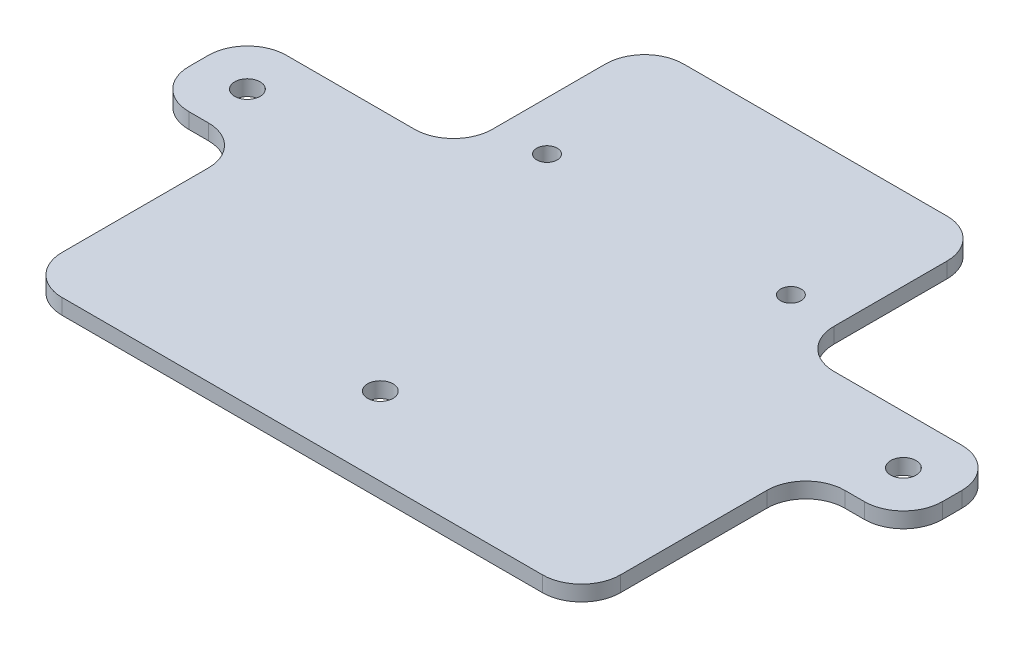
ISO-10303-21;
HEADER;
FILE_DESCRIPTION(('STEP AP214'),'2;1');
FILE_NAME('part.step','',(''),(''),'','','');
FILE_SCHEMA(('AUTOMOTIVE_DESIGN { 1 0 10303 214 1 1 1 1 }'));
ENDSEC;
DATA;
#1=APPLICATION_CONTEXT('core data for automotive mechanical design processes');
#2=APPLICATION_PROTOCOL_DEFINITION('international standard','automotive_design',2000,#1);
#3=PRODUCT_CONTEXT('',#1,'mechanical');
#4=PRODUCT('Part','Part','',(#3));
#5=PRODUCT_RELATED_PRODUCT_CATEGORY('part','',(#4));
#6=PRODUCT_DEFINITION_FORMATION('','',#4);
#7=PRODUCT_DEFINITION_CONTEXT('part definition',#1,'design');
#8=PRODUCT_DEFINITION('design','',#6,#7);
#9=PRODUCT_DEFINITION_SHAPE('','',#8);
#10=(LENGTH_UNIT() NAMED_UNIT(*) SI_UNIT(.MILLI.,.METRE.));
#11=(NAMED_UNIT(*) PLANE_ANGLE_UNIT() SI_UNIT($,.RADIAN.));
#12=(NAMED_UNIT(*) SI_UNIT($,.STERADIAN.) SOLID_ANGLE_UNIT());
#13=UNCERTAINTY_MEASURE_WITH_UNIT(LENGTH_MEASURE(1.E-05),#10,'distance_accuracy_value','');
#14=(GEOMETRIC_REPRESENTATION_CONTEXT(3) GLOBAL_UNCERTAINTY_ASSIGNED_CONTEXT((#13)) GLOBAL_UNIT_ASSIGNED_CONTEXT((#10,
#11,#12)) REPRESENTATION_CONTEXT('',''));
#15=CARTESIAN_POINT('',(0.,0.,0.));
#16=DIRECTION('',(0.,0.,1.));
#17=DIRECTION('',(1.,0.,0.));
#18=AXIS2_PLACEMENT_3D('',#15,#16,#17);
#19=CARTESIAN_POINT('',(0.,3.175,0.));
#20=DIRECTION('',(0.,1.,0.));
#21=DIRECTION('',(0.,0.,1.));
#22=AXIS2_PLACEMENT_3D('',#19,#20,#21);
#23=PLANE('',#22);
#24=CARTESIAN_POINT('',(67.25,3.175,94.175));
#25=DIRECTION('',(0.,1.,0.));
#26=DIRECTION('',(0.,0.,1.));
#27=AXIS2_PLACEMENT_3D('',#24,#25,#26);
#28=CIRCLE('',#27,2.6);
#29=CARTESIAN_POINT('',(67.25,3.175,96.775));
#30=VERTEX_POINT('',#29);
#31=EDGE_CURVE('E752',#30,#30,#28,.T.);
#32=ORIENTED_EDGE('',*,*,#31,.F.);
#33=EDGE_LOOP('',(#32));
#34=FACE_BOUND('',#33,.T.);
#35=CARTESIAN_POINT('',(25.,3.175,75.));
#36=DIRECTION('',(0.,1.,0.));
#37=DIRECTION('',(0.,0.,1.));
#38=AXIS2_PLACEMENT_3D('',#35,#36,#37);
#39=CIRCLE('',#38,2.1);
#40=CARTESIAN_POINT('',(25.,3.175,77.1));
#41=VERTEX_POINT('',#40);
#42=EDGE_CURVE('E737',#41,#41,#39,.T.);
#43=ORIENTED_EDGE('',*,*,#42,.F.);
#44=EDGE_LOOP('',(#43));
#45=FACE_BOUND('',#44,.T.);
#46=DIRECTION('',(-1.,0.,0.));
#47=VECTOR('',#46,1.);
#48=CARTESIAN_POINT('',(-35.,3.175,84.175));
#49=LINE('',#48,#47);
#50=CARTESIAN_POINT('',(-43.,3.175,84.175));
#51=VERTEX_POINT('',#50);
#52=CARTESIAN_POINT('',(-69.25,3.175,84.175));
#53=VERTEX_POINT('',#52);
#54=EDGE_CURVE('E216',#51,#53,#49,.T.);
#55=ORIENTED_EDGE('',*,*,#54,.T.);
#56=CARTESIAN_POINT('',(-69.25,3.175,92.175));
#57=DIRECTION('',(0.,1.,0.));
#58=DIRECTION('',(0.,0.,1.));
#59=AXIS2_PLACEMENT_3D('',#56,#57,#58);
#60=CIRCLE('',#59,8.);
#61=CARTESIAN_POINT('',(-77.25,3.175,92.175));
#62=VERTEX_POINT('',#61);
#63=EDGE_CURVE('E301',#53,#62,#60,.T.);
#64=ORIENTED_EDGE('',*,*,#63,.T.);
#65=DIRECTION('',(0.,0.,1.));
#66=VECTOR('',#65,1.);
#67=CARTESIAN_POINT('',(-77.25,3.175,84.175));
#68=LINE('',#67,#66);
#69=CARTESIAN_POINT('',(-77.25,3.175,96.175));
#70=VERTEX_POINT('',#69);
#71=EDGE_CURVE('E385',#62,#70,#68,.T.);
#72=ORIENTED_EDGE('',*,*,#71,.T.);
#73=CARTESIAN_POINT('',(-69.25,3.175,96.175));
#74=DIRECTION('',(0.,1.,0.));
#75=DIRECTION('',(0.,0.,1.));
#76=AXIS2_PLACEMENT_3D('',#73,#74,#75);
#77=CIRCLE('',#76,8.);
#78=CARTESIAN_POINT('',(-69.25,3.175,104.175));
#79=VERTEX_POINT('',#78);
#80=EDGE_CURVE('E299',#70,#79,#77,.T.);
#81=ORIENTED_EDGE('',*,*,#80,.T.);
#82=DIRECTION('',(1.,0.,0.));
#83=VECTOR('',#82,1.);
#84=CARTESIAN_POINT('',(-77.25,3.175,104.175));
#85=LINE('',#84,#83);
#86=CARTESIAN_POINT('',(-65.25,3.175,104.175));
#87=VERTEX_POINT('',#86);
#88=EDGE_CURVE('E388',#79,#87,#85,.T.);
#89=ORIENTED_EDGE('',*,*,#88,.T.);
#90=CARTESIAN_POINT('',(-65.25,3.175,112.175));
#91=DIRECTION('',(0.,1.,0.));
#92=DIRECTION('',(0.,0.,1.));
#93=AXIS2_PLACEMENT_3D('',#90,#91,#92);
#94=CIRCLE('',#93,8.);
#95=CARTESIAN_POINT('',(-57.25,3.175,112.175));
#96=VERTEX_POINT('',#95);
#97=EDGE_CURVE('E351',#87,#96,#94,.F.);
#98=ORIENTED_EDGE('',*,*,#97,.T.);
#99=DIRECTION('',(0.,0.,1.));
#100=VECTOR('',#99,1.);
#101=CARTESIAN_POINT('',(-57.25,3.175,104.175));
#102=LINE('',#101,#100);
#103=CARTESIAN_POINT('',(-57.25,3.175,142.175));
#104=VERTEX_POINT('',#103);
#105=EDGE_CURVE('E391',#96,#104,#102,.T.);
#106=ORIENTED_EDGE('',*,*,#105,.T.);
#107=CARTESIAN_POINT('',(-49.25,3.175,142.175));
#108=DIRECTION('',(0.,1.,0.));
#109=DIRECTION('',(0.,0.,1.));
#110=AXIS2_PLACEMENT_3D('',#107,#108,#109);
#111=CIRCLE('',#110,8.);
#112=CARTESIAN_POINT('',(-49.25,3.175,150.175));
#113=VERTEX_POINT('',#112);
#114=EDGE_CURVE('E297',#104,#113,#111,.T.);
#115=ORIENTED_EDGE('',*,*,#114,.T.);
#116=DIRECTION('',(1.,0.,0.));
#117=VECTOR('',#116,1.);
#118=CARTESIAN_POINT('',(-57.25,3.175,150.175));
#119=LINE('',#118,#117);
#120=CARTESIAN_POINT('',(49.25,3.175,150.175));
#121=VERTEX_POINT('',#120);
#122=EDGE_CURVE('E395',#113,#121,#119,.T.);
#123=ORIENTED_EDGE('',*,*,#122,.T.);
#124=CARTESIAN_POINT('',(49.25,3.175,142.175));
#125=DIRECTION('',(0.,1.,0.));
#126=DIRECTION('',(0.,0.,1.));
#127=AXIS2_PLACEMENT_3D('',#124,#125,#126);
#128=CIRCLE('',#127,8.);
#129=CARTESIAN_POINT('',(57.25,3.175,142.175));
#130=VERTEX_POINT('',#129);
#131=EDGE_CURVE('E294',#121,#130,#128,.T.);
#132=ORIENTED_EDGE('',*,*,#131,.T.);
#133=DIRECTION('',(0.,0.,-1.));
#134=VECTOR('',#133,1.);
#135=CARTESIAN_POINT('',(57.25,3.175,104.175));
#136=LINE('',#135,#134);
#137=CARTESIAN_POINT('',(57.25,3.175,112.175));
#138=VERTEX_POINT('',#137);
#139=EDGE_CURVE('E398',#130,#138,#136,.T.);
#140=ORIENTED_EDGE('',*,*,#139,.T.);
#141=CARTESIAN_POINT('',(65.25,3.175,112.175));
#142=DIRECTION('',(0.,1.,0.));
#143=DIRECTION('',(0.,0.,1.));
#144=AXIS2_PLACEMENT_3D('',#141,#142,#143);
#145=CIRCLE('',#144,8.);
#146=CARTESIAN_POINT('',(65.25,3.175,104.175));
#147=VERTEX_POINT('',#146);
#148=EDGE_CURVE('E355',#138,#147,#145,.F.);
#149=ORIENTED_EDGE('',*,*,#148,.T.);
#150=DIRECTION('',(1.,0.,0.));
#151=VECTOR('',#150,1.);
#152=CARTESIAN_POINT('',(77.25,3.175,104.175));
#153=LINE('',#152,#151);
#154=CARTESIAN_POINT('',(69.25,3.175,104.175));
#155=VERTEX_POINT('',#154);
#156=EDGE_CURVE('E402',#147,#155,#153,.T.);
#157=ORIENTED_EDGE('',*,*,#156,.T.);
#158=CARTESIAN_POINT('',(69.25,3.175,96.175));
#159=DIRECTION('',(0.,1.,0.));
#160=DIRECTION('',(0.,0.,1.));
#161=AXIS2_PLACEMENT_3D('',#158,#159,#160);
#162=CIRCLE('',#161,8.);
#163=CARTESIAN_POINT('',(77.25,3.175,96.175));
#164=VERTEX_POINT('',#163);
#165=EDGE_CURVE('E292',#155,#164,#162,.T.);
#166=ORIENTED_EDGE('',*,*,#165,.T.);
#167=DIRECTION('',(0.,0.,-1.));
#168=VECTOR('',#167,1.);
#169=CARTESIAN_POINT('',(77.25,3.175,84.175));
#170=LINE('',#169,#168);
#171=CARTESIAN_POINT('',(77.25,3.175,92.175));
#172=VERTEX_POINT('',#171);
#173=EDGE_CURVE('E405',#164,#172,#170,.T.);
#174=ORIENTED_EDGE('',*,*,#173,.T.);
#175=CARTESIAN_POINT('',(69.25,3.175,92.175));
#176=DIRECTION('',(0.,1.,0.));
#177=DIRECTION('',(0.,0.,1.));
#178=AXIS2_PLACEMENT_3D('',#175,#176,#177);
#179=CIRCLE('',#178,8.);
#180=CARTESIAN_POINT('',(69.25,3.175,84.175));
#181=VERTEX_POINT('',#180);
#182=EDGE_CURVE('E56',#172,#181,#179,.T.);
#183=ORIENTED_EDGE('',*,*,#182,.T.);
#184=DIRECTION('',(-1.,0.,0.));
#185=VECTOR('',#184,1.);
#186=CARTESIAN_POINT('',(35.,3.175,84.175));
#187=LINE('',#186,#185);
#188=CARTESIAN_POINT('',(43.,3.175,84.175));
#189=VERTEX_POINT('',#188);
#190=EDGE_CURVE('E258',#181,#189,#187,.T.);
#191=ORIENTED_EDGE('',*,*,#190,.T.);
#192=CARTESIAN_POINT('',(43.,3.175,76.175));
#193=DIRECTION('',(0.,1.,0.));
#194=DIRECTION('',(0.,0.,1.));
#195=AXIS2_PLACEMENT_3D('',#192,#193,#194);
#196=CIRCLE('',#195,8.);
#197=CARTESIAN_POINT('',(35.,3.175,76.175));
#198=VERTEX_POINT('',#197);
#199=EDGE_CURVE('E11',#189,#198,#196,.F.);
#200=ORIENTED_EDGE('',*,*,#199,.T.);
#201=DIRECTION('',(0.,0.,-1.));
#202=VECTOR('',#201,1.);
#203=CARTESIAN_POINT('',(35.,3.175,45.));
#204=LINE('',#203,#202);
#205=CARTESIAN_POINT('',(35.,3.175,53.));
#206=VERTEX_POINT('',#205);
#207=EDGE_CURVE('E257',#198,#206,#204,.T.);
#208=ORIENTED_EDGE('',*,*,#207,.T.);
#209=CARTESIAN_POINT('',(27.,3.175,53.));
#210=DIRECTION('',(0.,1.,0.));
#211=DIRECTION('',(0.,0.,1.));
#212=AXIS2_PLACEMENT_3D('',#209,#210,#211);
#213=CIRCLE('',#212,8.);
#214=CARTESIAN_POINT('',(27.,3.175,45.));
#215=VERTEX_POINT('',#214);
#216=EDGE_CURVE('E286',#206,#215,#213,.T.);
#217=ORIENTED_EDGE('',*,*,#216,.T.);
#218=DIRECTION('',(-1.,0.,0.));
#219=VECTOR('',#218,1.);
#220=CARTESIAN_POINT('',(-35.,3.175,45.));
#221=LINE('',#220,#219);
#222=CARTESIAN_POINT('',(-27.,3.175,45.));
#223=VERTEX_POINT('',#222);
#224=EDGE_CURVE('E373',#215,#223,#221,.T.);
#225=ORIENTED_EDGE('',*,*,#224,.T.);
#226=CARTESIAN_POINT('',(-27.,3.175,53.));
#227=DIRECTION('',(0.,1.,0.));
#228=DIRECTION('',(0.,0.,1.));
#229=AXIS2_PLACEMENT_3D('',#226,#227,#228);
#230=CIRCLE('',#229,8.);
#231=CARTESIAN_POINT('',(-35.,3.175,53.));
#232=VERTEX_POINT('',#231);
#233=EDGE_CURVE('E288',#223,#232,#230,.T.);
#234=ORIENTED_EDGE('',*,*,#233,.T.);
#235=DIRECTION('',(0.,0.,1.));
#236=VECTOR('',#235,1.);
#237=CARTESIAN_POINT('',(-35.,3.175,45.));
#238=LINE('',#237,#236);
#239=CARTESIAN_POINT('',(-35.,3.175,76.175));
#240=VERTEX_POINT('',#239);
#241=EDGE_CURVE('E376',#232,#240,#238,.T.);
#242=ORIENTED_EDGE('',*,*,#241,.T.);
#243=CARTESIAN_POINT('',(-43.,3.175,76.175));
#244=DIRECTION('',(0.,1.,0.));
#245=DIRECTION('',(0.,0.,1.));
#246=AXIS2_PLACEMENT_3D('',#243,#244,#245);
#247=CIRCLE('',#246,8.);
#248=EDGE_CURVE('E206',#240,#51,#247,.F.);
#249=ORIENTED_EDGE('',*,*,#248,.T.);
#250=EDGE_LOOP('',(#55,#64,#72,#81,#89,#98,#106,#115,#123,#132,#140,#149,#157,#166,#174,#183,
#191,#200,#208,#217,#225,#234,#242,#249));
#251=FACE_BOUND('',#250,.T.);
#252=CARTESIAN_POINT('',(-25.,3.175,75.));
#253=DIRECTION('',(0.,1.,0.));
#254=DIRECTION('',(0.,0.,1.));
#255=AXIS2_PLACEMENT_3D('',#252,#253,#254);
#256=CIRCLE('',#255,2.1);
#257=CARTESIAN_POINT('',(-25.,3.175,77.1));
#258=VERTEX_POINT('',#257);
#259=EDGE_CURVE('E408',#258,#258,#256,.T.);
#260=ORIENTED_EDGE('',*,*,#259,.F.);
#261=EDGE_LOOP('',(#260));
#262=FACE_BOUND('',#261,.T.);
#263=CARTESIAN_POINT('',(-67.25,3.175,94.175));
#264=DIRECTION('',(0.,1.,0.));
#265=DIRECTION('',(0.,0.,1.));
#266=AXIS2_PLACEMENT_3D('',#263,#264,#265);
#267=CIRCLE('',#266,2.6);
#268=CARTESIAN_POINT('',(-67.25,3.175,96.775));
#269=VERTEX_POINT('',#268);
#270=EDGE_CURVE('E746',#269,#269,#267,.T.);
#271=ORIENTED_EDGE('',*,*,#270,.F.);
#272=EDGE_LOOP('',(#271));
#273=FACE_BOUND('',#272,.T.);
#274=CARTESIAN_POINT('',(0.,3.175,134.175));
#275=DIRECTION('',(0.,1.,0.));
#276=DIRECTION('',(0.,0.,1.));
#277=AXIS2_PLACEMENT_3D('',#274,#275,#276);
#278=CIRCLE('',#277,2.6);
#279=CARTESIAN_POINT('',(0.,3.175,136.775));
#280=VERTEX_POINT('',#279);
#281=EDGE_CURVE('E759',#280,#280,#278,.T.);
#282=ORIENTED_EDGE('',*,*,#281,.F.);
#283=EDGE_LOOP('',(#282));
#284=FACE_BOUND('',#283,.T.);
#285=ADVANCED_FACE('F34',(#34,#45,#251,#262,#273,#284),#23,.T.);
#286=CARTESIAN_POINT('',(0.,0.,0.));
#287=DIRECTION('',(0.,1.,0.));
#288=DIRECTION('',(0.,0.,1.));
#289=AXIS2_PLACEMENT_3D('',#286,#287,#288);
#290=PLANE('',#289);
#291=CARTESIAN_POINT('',(67.25,0.,94.175));
#292=DIRECTION('',(0.,1.,0.));
#293=DIRECTION('',(0.,0.,1.));
#294=AXIS2_PLACEMENT_3D('',#291,#292,#293);
#295=CIRCLE('',#294,2.6);
#296=CARTESIAN_POINT('',(67.25,0.,96.775));
#297=VERTEX_POINT('',#296);
#298=EDGE_CURVE('E755',#297,#297,#295,.T.);
#299=ORIENTED_EDGE('',*,*,#298,.T.);
#300=EDGE_LOOP('',(#299));
#301=FACE_BOUND('',#300,.T.);
#302=CARTESIAN_POINT('',(25.,0.,75.));
#303=DIRECTION('',(0.,1.,0.));
#304=DIRECTION('',(0.,0.,1.));
#305=AXIS2_PLACEMENT_3D('',#302,#303,#304);
#306=CIRCLE('',#305,2.1);
#307=CARTESIAN_POINT('',(25.,0.,77.1));
#308=VERTEX_POINT('',#307);
#309=EDGE_CURVE('E741',#308,#308,#306,.T.);
#310=ORIENTED_EDGE('',*,*,#309,.T.);
#311=EDGE_LOOP('',(#310));
#312=FACE_BOUND('',#311,.T.);
#313=DIRECTION('',(0.,0.,1.));
#314=VECTOR('',#313,1.);
#315=CARTESIAN_POINT('',(-77.25,0.,84.175));
#316=LINE('',#315,#314);
#317=CARTESIAN_POINT('',(-77.25,0.,92.175));
#318=VERTEX_POINT('',#317);
#319=CARTESIAN_POINT('',(-77.25,0.,96.175));
#320=VERTEX_POINT('',#319);
#321=EDGE_CURVE('E224',#318,#320,#316,.T.);
#322=ORIENTED_EDGE('',*,*,#321,.F.);
#323=CARTESIAN_POINT('',(-69.25,0.,92.175));
#324=DIRECTION('',(0.,1.,0.));
#325=DIRECTION('',(0.,0.,1.));
#326=AXIS2_PLACEMENT_3D('',#323,#324,#325);
#327=CIRCLE('',#326,8.);
#328=CARTESIAN_POINT('',(-69.25,0.,84.175));
#329=VERTEX_POINT('',#328);
#330=EDGE_CURVE('E223',#318,#329,#327,.F.);
#331=ORIENTED_EDGE('',*,*,#330,.T.);
#332=DIRECTION('',(-1.,0.,0.));
#333=VECTOR('',#332,1.);
#334=CARTESIAN_POINT('',(-35.,0.,84.175));
#335=LINE('',#334,#333);
#336=CARTESIAN_POINT('',(-43.,0.,84.175));
#337=VERTEX_POINT('',#336);
#338=EDGE_CURVE('E213',#337,#329,#335,.T.);
#339=ORIENTED_EDGE('',*,*,#338,.F.);
#340=CARTESIAN_POINT('',(-43.,0.,76.175));
#341=DIRECTION('',(0.,1.,0.));
#342=DIRECTION('',(0.,0.,1.));
#343=AXIS2_PLACEMENT_3D('',#340,#341,#342);
#344=CIRCLE('',#343,8.);
#345=CARTESIAN_POINT('',(-35.,0.,76.175));
#346=VERTEX_POINT('',#345);
#347=EDGE_CURVE('E196',#337,#346,#344,.T.);
#348=ORIENTED_EDGE('',*,*,#347,.T.);
#349=DIRECTION('',(0.,0.,1.));
#350=VECTOR('',#349,1.);
#351=CARTESIAN_POINT('',(-35.,0.,45.));
#352=LINE('',#351,#350);
#353=CARTESIAN_POINT('',(-35.,0.,53.));
#354=VERTEX_POINT('',#353);
#355=EDGE_CURVE('E225',#354,#346,#352,.T.);
#356=ORIENTED_EDGE('',*,*,#355,.F.);
#357=CARTESIAN_POINT('',(-27.,0.,53.));
#358=DIRECTION('',(0.,1.,0.));
#359=DIRECTION('',(0.,0.,1.));
#360=AXIS2_PLACEMENT_3D('',#357,#358,#359);
#361=CIRCLE('',#360,8.);
#362=CARTESIAN_POINT('',(-27.,0.,45.));
#363=VERTEX_POINT('',#362);
#364=EDGE_CURVE('E270',#354,#363,#361,.F.);
#365=ORIENTED_EDGE('',*,*,#364,.T.);
#366=DIRECTION('',(-1.,0.,0.));
#367=VECTOR('',#366,1.);
#368=CARTESIAN_POINT('',(-35.,0.,45.));
#369=LINE('',#368,#367);
#370=CARTESIAN_POINT('',(27.,0.,45.));
#371=VERTEX_POINT('',#370);
#372=EDGE_CURVE('E230',#371,#363,#369,.T.);
#373=ORIENTED_EDGE('',*,*,#372,.F.);
#374=CARTESIAN_POINT('',(27.,0.,53.));
#375=DIRECTION('',(0.,1.,0.));
#376=DIRECTION('',(0.,0.,1.));
#377=AXIS2_PLACEMENT_3D('',#374,#375,#376);
#378=CIRCLE('',#377,8.);
#379=CARTESIAN_POINT('',(35.,0.,53.));
#380=VERTEX_POINT('',#379);
#381=EDGE_CURVE('E268',#371,#380,#378,.F.);
#382=ORIENTED_EDGE('',*,*,#381,.T.);
#383=DIRECTION('',(0.,0.,-1.));
#384=VECTOR('',#383,1.);
#385=CARTESIAN_POINT('',(35.,0.,45.));
#386=LINE('',#385,#384);
#387=CARTESIAN_POINT('',(35.,0.,76.175));
#388=VERTEX_POINT('',#387);
#389=EDGE_CURVE('E359',#388,#380,#386,.T.);
#390=ORIENTED_EDGE('',*,*,#389,.F.);
#391=CARTESIAN_POINT('',(43.,0.,76.175));
#392=DIRECTION('',(0.,1.,0.));
#393=DIRECTION('',(0.,0.,1.));
#394=AXIS2_PLACEMENT_3D('',#391,#392,#393);
#395=CIRCLE('',#394,8.);
#396=CARTESIAN_POINT('',(43.,0.,84.175));
#397=VERTEX_POINT('',#396);
#398=EDGE_CURVE('E42',#388,#397,#395,.T.);
#399=ORIENTED_EDGE('',*,*,#398,.T.);
#400=DIRECTION('',(-1.,0.,0.));
#401=VECTOR('',#400,1.);
#402=CARTESIAN_POINT('',(35.,0.,84.175));
#403=LINE('',#402,#401);
#404=CARTESIAN_POINT('',(69.25,0.,84.175));
#405=VERTEX_POINT('',#404);
#406=EDGE_CURVE('E255',#405,#397,#403,.T.);
#407=ORIENTED_EDGE('',*,*,#406,.F.);
#408=CARTESIAN_POINT('',(69.25,0.,92.175));
#409=DIRECTION('',(0.,1.,0.));
#410=DIRECTION('',(0.,0.,1.));
#411=AXIS2_PLACEMENT_3D('',#408,#409,#410);
#412=CIRCLE('',#411,8.);
#413=CARTESIAN_POINT('',(77.25,0.,92.175));
#414=VERTEX_POINT('',#413);
#415=EDGE_CURVE('E273',#405,#414,#412,.F.);
#416=ORIENTED_EDGE('',*,*,#415,.T.);
#417=DIRECTION('',(0.,0.,-1.));
#418=VECTOR('',#417,1.);
#419=CARTESIAN_POINT('',(77.25,0.,84.175));
#420=LINE('',#419,#418);
#421=CARTESIAN_POINT('',(77.25,0.,96.175));
#422=VERTEX_POINT('',#421);
#423=EDGE_CURVE('E251',#422,#414,#420,.T.);
#424=ORIENTED_EDGE('',*,*,#423,.F.);
#425=CARTESIAN_POINT('',(69.25,0.,96.175));
#426=DIRECTION('',(0.,1.,0.));
#427=DIRECTION('',(0.,0.,1.));
#428=AXIS2_PLACEMENT_3D('',#425,#426,#427);
#429=CIRCLE('',#428,8.);
#430=CARTESIAN_POINT('',(69.25,0.,104.175));
#431=VERTEX_POINT('',#430);
#432=EDGE_CURVE('E275',#422,#431,#429,.F.);
#433=ORIENTED_EDGE('',*,*,#432,.T.);
#434=DIRECTION('',(1.,0.,0.));
#435=VECTOR('',#434,1.);
#436=CARTESIAN_POINT('',(77.25,0.,104.175));
#437=LINE('',#436,#435);
#438=CARTESIAN_POINT('',(65.25,0.,104.175));
#439=VERTEX_POINT('',#438);
#440=EDGE_CURVE('E247',#439,#431,#437,.T.);
#441=ORIENTED_EDGE('',*,*,#440,.F.);
#442=CARTESIAN_POINT('',(65.25,0.,112.175));
#443=DIRECTION('',(0.,1.,0.));
#444=DIRECTION('',(0.,0.,1.));
#445=AXIS2_PLACEMENT_3D('',#442,#443,#444);
#446=CIRCLE('',#445,8.);
#447=CARTESIAN_POINT('',(57.25,0.,112.175));
#448=VERTEX_POINT('',#447);
#449=EDGE_CURVE('E353',#439,#448,#446,.T.);
#450=ORIENTED_EDGE('',*,*,#449,.T.);
#451=DIRECTION('',(0.,0.,-1.));
#452=VECTOR('',#451,1.);
#453=CARTESIAN_POINT('',(57.25,0.,104.175));
#454=LINE('',#453,#452);
#455=CARTESIAN_POINT('',(57.25,0.,142.175));
#456=VERTEX_POINT('',#455);
#457=EDGE_CURVE('E244',#456,#448,#454,.T.);
#458=ORIENTED_EDGE('',*,*,#457,.F.);
#459=CARTESIAN_POINT('',(49.25,0.,142.175));
#460=DIRECTION('',(0.,1.,0.));
#461=DIRECTION('',(0.,0.,1.));
#462=AXIS2_PLACEMENT_3D('',#459,#460,#461);
#463=CIRCLE('',#462,8.);
#464=CARTESIAN_POINT('',(49.25,0.,150.175));
#465=VERTEX_POINT('',#464);
#466=EDGE_CURVE('E278',#456,#465,#463,.F.);
#467=ORIENTED_EDGE('',*,*,#466,.T.);
#468=DIRECTION('',(1.,0.,0.));
#469=VECTOR('',#468,1.);
#470=CARTESIAN_POINT('',(-57.25,0.,150.175));
#471=LINE('',#470,#469);
#472=CARTESIAN_POINT('',(-49.25,0.,150.175));
#473=VERTEX_POINT('',#472);
#474=EDGE_CURVE('E241',#473,#465,#471,.T.);
#475=ORIENTED_EDGE('',*,*,#474,.F.);
#476=CARTESIAN_POINT('',(-49.25,0.,142.175));
#477=DIRECTION('',(0.,1.,0.));
#478=DIRECTION('',(0.,0.,1.));
#479=AXIS2_PLACEMENT_3D('',#476,#477,#478);
#480=CIRCLE('',#479,8.);
#481=CARTESIAN_POINT('',(-57.25,0.,142.175));
#482=VERTEX_POINT('',#481);
#483=EDGE_CURVE('E280',#473,#482,#480,.F.);
#484=ORIENTED_EDGE('',*,*,#483,.T.);
#485=DIRECTION('',(0.,0.,1.));
#486=VECTOR('',#485,1.);
#487=CARTESIAN_POINT('',(-57.25,0.,104.175));
#488=LINE('',#487,#486);
#489=CARTESIAN_POINT('',(-57.25,0.,112.175));
#490=VERTEX_POINT('',#489);
#491=EDGE_CURVE('E237',#490,#482,#488,.T.);
#492=ORIENTED_EDGE('',*,*,#491,.F.);
#493=CARTESIAN_POINT('',(-65.25,0.,112.175));
#494=DIRECTION('',(0.,1.,0.));
#495=DIRECTION('',(0.,0.,1.));
#496=AXIS2_PLACEMENT_3D('',#493,#494,#495);
#497=CIRCLE('',#496,8.);
#498=CARTESIAN_POINT('',(-65.25,0.,104.175));
#499=VERTEX_POINT('',#498);
#500=EDGE_CURVE('E349',#490,#499,#497,.T.);
#501=ORIENTED_EDGE('',*,*,#500,.T.);
#502=DIRECTION('',(1.,0.,0.));
#503=VECTOR('',#502,1.);
#504=CARTESIAN_POINT('',(-77.25,0.,104.175));
#505=LINE('',#504,#503);
#506=CARTESIAN_POINT('',(-69.25,0.,104.175));
#507=VERTEX_POINT('',#506);
#508=EDGE_CURVE('E228',#507,#499,#505,.T.);
#509=ORIENTED_EDGE('',*,*,#508,.F.);
#510=CARTESIAN_POINT('',(-69.25,0.,96.175));
#511=DIRECTION('',(0.,1.,0.));
#512=DIRECTION('',(0.,0.,1.));
#513=AXIS2_PLACEMENT_3D('',#510,#511,#512);
#514=CIRCLE('',#513,8.);
#515=EDGE_CURVE('E283',#507,#320,#514,.F.);
#516=ORIENTED_EDGE('',*,*,#515,.T.);
#517=EDGE_LOOP('',(#322,#331,#339,#348,#356,#365,#373,#382,#390,#399,#407,#416,#424,#433,#441,
#450,#458,#467,#475,#484,#492,#501,#509,#516));
#518=FACE_BOUND('',#517,.T.);
#519=CARTESIAN_POINT('',(-25.,0.,75.));
#520=DIRECTION('',(0.,1.,0.));
#521=DIRECTION('',(0.,0.,1.));
#522=AXIS2_PLACEMENT_3D('',#519,#520,#521);
#523=CIRCLE('',#522,2.1);
#524=CARTESIAN_POINT('',(-25.,0.,77.1));
#525=VERTEX_POINT('',#524);
#526=EDGE_CURVE('E379',#525,#525,#523,.T.);
#527=ORIENTED_EDGE('',*,*,#526,.T.);
#528=EDGE_LOOP('',(#527));
#529=FACE_BOUND('',#528,.T.);
#530=CARTESIAN_POINT('',(-67.25,0.,94.175));
#531=DIRECTION('',(0.,1.,0.));
#532=DIRECTION('',(0.,0.,1.));
#533=AXIS2_PLACEMENT_3D('',#530,#531,#532);
#534=CIRCLE('',#533,2.6);
#535=CARTESIAN_POINT('',(-67.25,0.,96.775));
#536=VERTEX_POINT('',#535);
#537=EDGE_CURVE('E749',#536,#536,#534,.T.);
#538=ORIENTED_EDGE('',*,*,#537,.T.);
#539=EDGE_LOOP('',(#538));
#540=FACE_BOUND('',#539,.T.);
#541=CARTESIAN_POINT('',(0.,0.,134.175));
#542=DIRECTION('',(0.,1.,0.));
#543=DIRECTION('',(0.,0.,1.));
#544=AXIS2_PLACEMENT_3D('',#541,#542,#543);
#545=CIRCLE('',#544,2.6);
#546=CARTESIAN_POINT('',(0.,0.,136.775));
#547=VERTEX_POINT('',#546);
#548=EDGE_CURVE('E762',#547,#547,#545,.T.);
#549=ORIENTED_EDGE('',*,*,#548,.T.);
#550=EDGE_LOOP('',(#549));
#551=FACE_BOUND('',#550,.T.);
#552=ADVANCED_FACE('F221',(#301,#312,#518,#529,#540,#551),#290,.F.);
#553=CARTESIAN_POINT('',(35.,3.175,45.));
#554=DIRECTION('',(-1.,0.,0.));
#555=DIRECTION('',(0.,0.,1.));
#556=AXIS2_PLACEMENT_3D('',#553,#554,#555);
#557=PLANE('',#556);
#558=ORIENTED_EDGE('',*,*,#207,.F.);
#559=DIRECTION('',(0.,-1.,0.));
#560=VECTOR('',#559,1.);
#561=CARTESIAN_POINT('',(35.,0.,76.175));
#562=LINE('',#561,#560);
#563=EDGE_CURVE('E341',#198,#388,#562,.T.);
#564=ORIENTED_EDGE('',*,*,#563,.T.);
#565=ORIENTED_EDGE('',*,*,#389,.T.);
#566=DIRECTION('',(0.,-1.,0.));
#567=VECTOR('',#566,1.);
#568=CARTESIAN_POINT('',(35.,3.175,53.));
#569=LINE('',#568,#567);
#570=EDGE_CURVE('E339',#380,#206,#569,.F.);
#571=ORIENTED_EDGE('',*,*,#570,.T.);
#572=EDGE_LOOP('',(#558,#564,#565,#571));
#573=FACE_BOUND('',#572,.T.);
#574=ADVANCED_FACE('F371',(#573),#557,.F.);
#575=CARTESIAN_POINT('',(-35.,3.175,45.));
#576=DIRECTION('',(0.,0.,1.));
#577=DIRECTION('',(1.,0.,0.));
#578=AXIS2_PLACEMENT_3D('',#575,#576,#577);
#579=PLANE('',#578);
#580=ORIENTED_EDGE('',*,*,#372,.T.);
#581=DIRECTION('',(0.,-1.,0.));
#582=VECTOR('',#581,1.);
#583=CARTESIAN_POINT('',(-27.,3.175,45.));
#584=LINE('',#583,#582);
#585=EDGE_CURVE('E207',#363,#223,#584,.F.);
#586=ORIENTED_EDGE('',*,*,#585,.T.);
#587=ORIENTED_EDGE('',*,*,#224,.F.);
#588=DIRECTION('',(0.,-1.,0.));
#589=VECTOR('',#588,1.);
#590=CARTESIAN_POINT('',(27.,3.175,45.));
#591=LINE('',#590,#589);
#592=EDGE_CURVE('E344',#215,#371,#591,.T.);
#593=ORIENTED_EDGE('',*,*,#592,.T.);
#594=EDGE_LOOP('',(#580,#586,#587,#593));
#595=FACE_BOUND('',#594,.T.);
#596=ADVANCED_FACE('F413',(#595),#579,.F.);
#597=CARTESIAN_POINT('',(-35.,3.175,45.));
#598=DIRECTION('',(1.,0.,0.));
#599=DIRECTION('',(0.,0.,-1.));
#600=AXIS2_PLACEMENT_3D('',#597,#598,#599);
#601=PLANE('',#600);
#602=ORIENTED_EDGE('',*,*,#355,.T.);
#603=DIRECTION('',(0.,-1.,0.));
#604=VECTOR('',#603,1.);
#605=CARTESIAN_POINT('',(-35.,3.175,76.175));
#606=LINE('',#605,#604);
#607=EDGE_CURVE('E201',#346,#240,#606,.F.);
#608=ORIENTED_EDGE('',*,*,#607,.T.);
#609=ORIENTED_EDGE('',*,*,#241,.F.);
#610=DIRECTION('',(0.,-1.,0.));
#611=VECTOR('',#610,1.);
#612=CARTESIAN_POINT('',(-35.,3.175,53.));
#613=LINE('',#612,#611);
#614=EDGE_CURVE('E217',#232,#354,#613,.T.);
#615=ORIENTED_EDGE('',*,*,#614,.T.);
#616=EDGE_LOOP('',(#602,#608,#609,#615));
#617=FACE_BOUND('',#616,.T.);
#618=ADVANCED_FACE('F422',(#617),#601,.F.);
#619=CARTESIAN_POINT('',(-35.,3.175,84.175));
#620=DIRECTION('',(0.,0.,1.));
#621=DIRECTION('',(1.,0.,0.));
#622=AXIS2_PLACEMENT_3D('',#619,#620,#621);
#623=PLANE('',#622);
#624=ORIENTED_EDGE('',*,*,#54,.F.);
#625=DIRECTION('',(0.,-1.,0.));
#626=VECTOR('',#625,1.);
#627=CARTESIAN_POINT('',(-43.,0.,84.175));
#628=LINE('',#627,#626);
#629=EDGE_CURVE('E200',#51,#337,#628,.T.);
#630=ORIENTED_EDGE('',*,*,#629,.T.);
#631=ORIENTED_EDGE('',*,*,#338,.T.);
#632=DIRECTION('',(0.,-1.,0.));
#633=VECTOR('',#632,1.);
#634=CARTESIAN_POINT('',(-69.25,3.175,84.175));
#635=LINE('',#634,#633);
#636=EDGE_CURVE('E218',#329,#53,#635,.F.);
#637=ORIENTED_EDGE('',*,*,#636,.T.);
#638=EDGE_LOOP('',(#624,#630,#631,#637));
#639=FACE_BOUND('',#638,.T.);
#640=ADVANCED_FACE('F212',(#639),#623,.F.);
#641=CARTESIAN_POINT('',(-77.25,3.175,84.175));
#642=DIRECTION('',(1.,0.,0.));
#643=DIRECTION('',(0.,0.,-1.));
#644=AXIS2_PLACEMENT_3D('',#641,#642,#643);
#645=PLANE('',#644);
#646=ORIENTED_EDGE('',*,*,#71,.F.);
#647=DIRECTION('',(0.,-1.,0.));
#648=VECTOR('',#647,1.);
#649=CARTESIAN_POINT('',(-77.25,3.175,92.175));
#650=LINE('',#649,#648);
#651=EDGE_CURVE('E265',#62,#318,#650,.T.);
#652=ORIENTED_EDGE('',*,*,#651,.T.);
#653=ORIENTED_EDGE('',*,*,#321,.T.);
#654=DIRECTION('',(0.,-1.,0.));
#655=VECTOR('',#654,1.);
#656=CARTESIAN_POINT('',(-77.25,3.175,96.175));
#657=LINE('',#656,#655);
#658=EDGE_CURVE('E263',#320,#70,#657,.F.);
#659=ORIENTED_EDGE('',*,*,#658,.T.);
#660=EDGE_LOOP('',(#646,#652,#653,#659));
#661=FACE_BOUND('',#660,.T.);
#662=ADVANCED_FACE('F429',(#661),#645,.F.);
#663=CARTESIAN_POINT('',(-77.25,3.175,104.175));
#664=DIRECTION('',(0.,0.,-1.));
#665=DIRECTION('',(-1.,0.,0.));
#666=AXIS2_PLACEMENT_3D('',#663,#664,#665);
#667=PLANE('',#666);
#668=ORIENTED_EDGE('',*,*,#88,.F.);
#669=DIRECTION('',(0.,-1.,0.));
#670=VECTOR('',#669,1.);
#671=CARTESIAN_POINT('',(-69.25,3.175,104.175));
#672=LINE('',#671,#670);
#673=EDGE_CURVE('E306',#79,#507,#672,.T.);
#674=ORIENTED_EDGE('',*,*,#673,.T.);
#675=ORIENTED_EDGE('',*,*,#508,.T.);
#676=DIRECTION('',(0.,-1.,0.));
#677=VECTOR('',#676,1.);
#678=CARTESIAN_POINT('',(-65.25,3.175,104.175));
#679=LINE('',#678,#677);
#680=EDGE_CURVE('E303',#499,#87,#679,.F.);
#681=ORIENTED_EDGE('',*,*,#680,.T.);
#682=EDGE_LOOP('',(#668,#674,#675,#681));
#683=FACE_BOUND('',#682,.T.);
#684=ADVANCED_FACE('F467',(#683),#667,.F.);
#685=CARTESIAN_POINT('',(-57.25,3.175,104.175));
#686=DIRECTION('',(1.,0.,0.));
#687=DIRECTION('',(0.,0.,-1.));
#688=AXIS2_PLACEMENT_3D('',#685,#686,#687);
#689=PLANE('',#688);
#690=ORIENTED_EDGE('',*,*,#105,.F.);
#691=DIRECTION('',(0.,-1.,0.));
#692=VECTOR('',#691,1.);
#693=CARTESIAN_POINT('',(-57.25,0.,112.175));
#694=LINE('',#693,#692);
#695=EDGE_CURVE('E312',#96,#490,#694,.T.);
#696=ORIENTED_EDGE('',*,*,#695,.T.);
#697=ORIENTED_EDGE('',*,*,#491,.T.);
#698=DIRECTION('',(0.,-1.,0.));
#699=VECTOR('',#698,1.);
#700=CARTESIAN_POINT('',(-57.25,3.175,142.175));
#701=LINE('',#700,#699);
#702=EDGE_CURVE('E309',#482,#104,#701,.F.);
#703=ORIENTED_EDGE('',*,*,#702,.T.);
#704=EDGE_LOOP('',(#690,#696,#697,#703));
#705=FACE_BOUND('',#704,.T.);
#706=ADVANCED_FACE('F463',(#705),#689,.F.);
#707=CARTESIAN_POINT('',(-57.25,3.175,150.175));
#708=DIRECTION('',(0.,0.,-1.));
#709=DIRECTION('',(-1.,0.,0.));
#710=AXIS2_PLACEMENT_3D('',#707,#708,#709);
#711=PLANE('',#710);
#712=ORIENTED_EDGE('',*,*,#122,.F.);
#713=DIRECTION('',(0.,-1.,0.));
#714=VECTOR('',#713,1.);
#715=CARTESIAN_POINT('',(-49.25,3.175,150.175));
#716=LINE('',#715,#714);
#717=EDGE_CURVE('E317',#113,#473,#716,.T.);
#718=ORIENTED_EDGE('',*,*,#717,.T.);
#719=ORIENTED_EDGE('',*,*,#474,.T.);
#720=DIRECTION('',(0.,-1.,0.));
#721=VECTOR('',#720,1.);
#722=CARTESIAN_POINT('',(49.25,3.175,150.175));
#723=LINE('',#722,#721);
#724=EDGE_CURVE('E315',#465,#121,#723,.F.);
#725=ORIENTED_EDGE('',*,*,#724,.T.);
#726=EDGE_LOOP('',(#712,#718,#719,#725));
#727=FACE_BOUND('',#726,.T.);
#728=ADVANCED_FACE('F459',(#727),#711,.F.);
#729=CARTESIAN_POINT('',(57.25,3.175,104.175));
#730=DIRECTION('',(-1.,0.,0.));
#731=DIRECTION('',(0.,0.,1.));
#732=AXIS2_PLACEMENT_3D('',#729,#730,#731);
#733=PLANE('',#732);
#734=ORIENTED_EDGE('',*,*,#139,.F.);
#735=DIRECTION('',(0.,-1.,0.));
#736=VECTOR('',#735,1.);
#737=CARTESIAN_POINT('',(57.25,3.175,142.175));
#738=LINE('',#737,#736);
#739=EDGE_CURVE('E322',#130,#456,#738,.T.);
#740=ORIENTED_EDGE('',*,*,#739,.T.);
#741=ORIENTED_EDGE('',*,*,#457,.T.);
#742=DIRECTION('',(0.,-1.,0.));
#743=VECTOR('',#742,1.);
#744=CARTESIAN_POINT('',(57.25,3.175,112.175));
#745=LINE('',#744,#743);
#746=EDGE_CURVE('E320',#448,#138,#745,.F.);
#747=ORIENTED_EDGE('',*,*,#746,.T.);
#748=EDGE_LOOP('',(#734,#740,#741,#747));
#749=FACE_BOUND('',#748,.T.);
#750=ADVANCED_FACE('F455',(#749),#733,.F.);
#751=CARTESIAN_POINT('',(77.25,3.175,104.175));
#752=DIRECTION('',(0.,0.,-1.));
#753=DIRECTION('',(-1.,0.,0.));
#754=AXIS2_PLACEMENT_3D('',#751,#752,#753);
#755=PLANE('',#754);
#756=ORIENTED_EDGE('',*,*,#156,.F.);
#757=DIRECTION('',(0.,-1.,0.));
#758=VECTOR('',#757,1.);
#759=CARTESIAN_POINT('',(65.25,0.,104.175));
#760=LINE('',#759,#758);
#761=EDGE_CURVE('E327',#147,#439,#760,.T.);
#762=ORIENTED_EDGE('',*,*,#761,.T.);
#763=ORIENTED_EDGE('',*,*,#440,.T.);
#764=DIRECTION('',(0.,-1.,0.));
#765=VECTOR('',#764,1.);
#766=CARTESIAN_POINT('',(69.25,3.175,104.175));
#767=LINE('',#766,#765);
#768=EDGE_CURVE('E325',#431,#155,#767,.F.);
#769=ORIENTED_EDGE('',*,*,#768,.T.);
#770=EDGE_LOOP('',(#756,#762,#763,#769));
#771=FACE_BOUND('',#770,.T.);
#772=ADVANCED_FACE('F451',(#771),#755,.F.);
#773=CARTESIAN_POINT('',(77.25,3.175,84.175));
#774=DIRECTION('',(-1.,0.,0.));
#775=DIRECTION('',(0.,0.,1.));
#776=AXIS2_PLACEMENT_3D('',#773,#774,#775);
#777=PLANE('',#776);
#778=ORIENTED_EDGE('',*,*,#173,.F.);
#779=DIRECTION('',(0.,-1.,0.));
#780=VECTOR('',#779,1.);
#781=CARTESIAN_POINT('',(77.25,3.175,96.175));
#782=LINE('',#781,#780);
#783=EDGE_CURVE('E332',#164,#422,#782,.T.);
#784=ORIENTED_EDGE('',*,*,#783,.T.);
#785=ORIENTED_EDGE('',*,*,#423,.T.);
#786=DIRECTION('',(0.,-1.,0.));
#787=VECTOR('',#786,1.);
#788=CARTESIAN_POINT('',(77.25,3.175,92.175));
#789=LINE('',#788,#787);
#790=EDGE_CURVE('E330',#414,#172,#789,.F.);
#791=ORIENTED_EDGE('',*,*,#790,.T.);
#792=EDGE_LOOP('',(#778,#784,#785,#791));
#793=FACE_BOUND('',#792,.T.);
#794=ADVANCED_FACE('F448',(#793),#777,.F.);
#795=CARTESIAN_POINT('',(35.,3.175,84.175));
#796=DIRECTION('',(0.,0.,1.));
#797=DIRECTION('',(1.,0.,0.));
#798=AXIS2_PLACEMENT_3D('',#795,#796,#797);
#799=PLANE('',#798);
#800=ORIENTED_EDGE('',*,*,#190,.F.);
#801=DIRECTION('',(0.,-1.,0.));
#802=VECTOR('',#801,1.);
#803=CARTESIAN_POINT('',(69.25,3.175,84.175));
#804=LINE('',#803,#802);
#805=EDGE_CURVE('E336',#181,#405,#804,.T.);
#806=ORIENTED_EDGE('',*,*,#805,.T.);
#807=ORIENTED_EDGE('',*,*,#406,.T.);
#808=DIRECTION('',(0.,-1.,0.));
#809=VECTOR('',#808,1.);
#810=CARTESIAN_POINT('',(43.,3.175,84.175));
#811=LINE('',#810,#809);
#812=EDGE_CURVE('E49',#397,#189,#811,.F.);
#813=ORIENTED_EDGE('',*,*,#812,.T.);
#814=EDGE_LOOP('',(#800,#806,#807,#813));
#815=FACE_BOUND('',#814,.T.);
#816=ADVANCED_FACE('F362',(#815),#799,.F.);
#817=CARTESIAN_POINT('',(-25.,3.175,75.));
#818=DIRECTION('',(0.,-1.,0.));
#819=DIRECTION('',(0.,0.,-1.));
#820=AXIS2_PLACEMENT_3D('',#817,#818,#819);
#821=CYLINDRICAL_SURFACE('',#820,2.1);
#822=ORIENTED_EDGE('',*,*,#259,.T.);
#823=EDGE_LOOP('',(#822));
#824=FACE_BOUND('',#823,.T.);
#825=ORIENTED_EDGE('',*,*,#526,.F.);
#826=EDGE_LOOP('',(#825));
#827=FACE_BOUND('',#826,.T.);
#828=ADVANCED_FACE('F443',(#824,#827),#821,.F.);
#829=CARTESIAN_POINT('',(25.,3.175,75.));
#830=DIRECTION('',(0.,-1.,0.));
#831=DIRECTION('',(0.,0.,-1.));
#832=AXIS2_PLACEMENT_3D('',#829,#830,#831);
#833=CYLINDRICAL_SURFACE('',#832,2.1);
#834=ORIENTED_EDGE('',*,*,#42,.T.);
#835=EDGE_LOOP('',(#834));
#836=FACE_BOUND('',#835,.T.);
#837=ORIENTED_EDGE('',*,*,#309,.F.);
#838=EDGE_LOOP('',(#837));
#839=FACE_BOUND('',#838,.T.);
#840=ADVANCED_FACE('F708',(#836,#839),#833,.F.);
#841=CARTESIAN_POINT('',(-67.25,3.175,94.175));
#842=DIRECTION('',(0.,-1.,0.));
#843=DIRECTION('',(0.,0.,-1.));
#844=AXIS2_PLACEMENT_3D('',#841,#842,#843);
#845=CYLINDRICAL_SURFACE('',#844,2.6);
#846=ORIENTED_EDGE('',*,*,#270,.T.);
#847=EDGE_LOOP('',(#846));
#848=FACE_BOUND('',#847,.T.);
#849=ORIENTED_EDGE('',*,*,#537,.F.);
#850=EDGE_LOOP('',(#849));
#851=FACE_BOUND('',#850,.T.);
#852=ADVANCED_FACE('F696',(#848,#851),#845,.F.);
#853=CARTESIAN_POINT('',(67.25,3.175,94.175));
#854=DIRECTION('',(0.,-1.,0.));
#855=DIRECTION('',(0.,0.,-1.));
#856=AXIS2_PLACEMENT_3D('',#853,#854,#855);
#857=CYLINDRICAL_SURFACE('',#856,2.6);
#858=ORIENTED_EDGE('',*,*,#31,.T.);
#859=EDGE_LOOP('',(#858));
#860=FACE_BOUND('',#859,.T.);
#861=ORIENTED_EDGE('',*,*,#298,.F.);
#862=EDGE_LOOP('',(#861));
#863=FACE_BOUND('',#862,.T.);
#864=ADVANCED_FACE('F685',(#860,#863),#857,.F.);
#865=CARTESIAN_POINT('',(0.,3.175,134.175));
#866=DIRECTION('',(0.,-1.,0.));
#867=DIRECTION('',(0.,0.,-1.));
#868=AXIS2_PLACEMENT_3D('',#865,#866,#867);
#869=CYLINDRICAL_SURFACE('',#868,2.6);
#870=ORIENTED_EDGE('',*,*,#281,.T.);
#871=EDGE_LOOP('',(#870));
#872=FACE_BOUND('',#871,.T.);
#873=ORIENTED_EDGE('',*,*,#548,.F.);
#874=EDGE_LOOP('',(#873));
#875=FACE_BOUND('',#874,.T.);
#876=ADVANCED_FACE('F493',(#872,#875),#869,.F.);
#877=CARTESIAN_POINT('',(-43.,3.175,76.175));
#878=DIRECTION('',(0.,1.,0.));
#879=DIRECTION('',(0.,0.,1.));
#880=AXIS2_PLACEMENT_3D('',#877,#878,#879);
#881=CYLINDRICAL_SURFACE('',#880,8.);
#882=ORIENTED_EDGE('',*,*,#248,.F.);
#883=ORIENTED_EDGE('',*,*,#607,.F.);
#884=ORIENTED_EDGE('',*,*,#347,.F.);
#885=ORIENTED_EDGE('',*,*,#629,.F.);
#886=EDGE_LOOP('',(#882,#883,#884,#885));
#887=FACE_BOUND('',#886,.T.);
#888=ADVANCED_FACE('F199',(#887),#881,.F.);
#889=CARTESIAN_POINT('',(-69.25,3.175,92.175));
#890=DIRECTION('',(0.,-1.,0.));
#891=DIRECTION('',(0.,0.,-1.));
#892=AXIS2_PLACEMENT_3D('',#889,#890,#891);
#893=CYLINDRICAL_SURFACE('',#892,8.);
#894=ORIENTED_EDGE('',*,*,#63,.F.);
#895=ORIENTED_EDGE('',*,*,#636,.F.);
#896=ORIENTED_EDGE('',*,*,#330,.F.);
#897=ORIENTED_EDGE('',*,*,#651,.F.);
#898=EDGE_LOOP('',(#894,#895,#896,#897));
#899=FACE_BOUND('',#898,.T.);
#900=ADVANCED_FACE('F482',(#899),#893,.T.);
#901=CARTESIAN_POINT('',(-69.25,3.175,96.175));
#902=DIRECTION('',(0.,-1.,0.));
#903=DIRECTION('',(0.,0.,-1.));
#904=AXIS2_PLACEMENT_3D('',#901,#902,#903);
#905=CYLINDRICAL_SURFACE('',#904,8.);
#906=ORIENTED_EDGE('',*,*,#80,.F.);
#907=ORIENTED_EDGE('',*,*,#658,.F.);
#908=ORIENTED_EDGE('',*,*,#515,.F.);
#909=ORIENTED_EDGE('',*,*,#673,.F.);
#910=EDGE_LOOP('',(#906,#907,#908,#909));
#911=FACE_BOUND('',#910,.T.);
#912=ADVANCED_FACE('F484',(#911),#905,.T.);
#913=CARTESIAN_POINT('',(-65.25,3.175,112.175));
#914=DIRECTION('',(0.,1.,0.));
#915=DIRECTION('',(0.,0.,1.));
#916=AXIS2_PLACEMENT_3D('',#913,#914,#915);
#917=CYLINDRICAL_SURFACE('',#916,8.);
#918=ORIENTED_EDGE('',*,*,#97,.F.);
#919=ORIENTED_EDGE('',*,*,#680,.F.);
#920=ORIENTED_EDGE('',*,*,#500,.F.);
#921=ORIENTED_EDGE('',*,*,#695,.F.);
#922=EDGE_LOOP('',(#918,#919,#920,#921));
#923=FACE_BOUND('',#922,.T.);
#924=ADVANCED_FACE('F490',(#923),#917,.F.);
#925=CARTESIAN_POINT('',(-49.25,3.175,142.175));
#926=DIRECTION('',(0.,-1.,0.));
#927=DIRECTION('',(0.,0.,-1.));
#928=AXIS2_PLACEMENT_3D('',#925,#926,#927);
#929=CYLINDRICAL_SURFACE('',#928,8.);
#930=ORIENTED_EDGE('',*,*,#114,.F.);
#931=ORIENTED_EDGE('',*,*,#702,.F.);
#932=ORIENTED_EDGE('',*,*,#483,.F.);
#933=ORIENTED_EDGE('',*,*,#717,.F.);
#934=EDGE_LOOP('',(#930,#931,#932,#933));
#935=FACE_BOUND('',#934,.T.);
#936=ADVANCED_FACE('F499',(#935),#929,.T.);
#937=CARTESIAN_POINT('',(49.25,3.175,142.175));
#938=DIRECTION('',(0.,-1.,0.));
#939=DIRECTION('',(0.,0.,-1.));
#940=AXIS2_PLACEMENT_3D('',#937,#938,#939);
#941=CYLINDRICAL_SURFACE('',#940,8.);
#942=ORIENTED_EDGE('',*,*,#131,.F.);
#943=ORIENTED_EDGE('',*,*,#724,.F.);
#944=ORIENTED_EDGE('',*,*,#466,.F.);
#945=ORIENTED_EDGE('',*,*,#739,.F.);
#946=EDGE_LOOP('',(#942,#943,#944,#945));
#947=FACE_BOUND('',#946,.T.);
#948=ADVANCED_FACE('F503',(#947),#941,.T.);
#949=CARTESIAN_POINT('',(65.25,3.175,112.175));
#950=DIRECTION('',(0.,1.,0.));
#951=DIRECTION('',(0.,0.,1.));
#952=AXIS2_PLACEMENT_3D('',#949,#950,#951);
#953=CYLINDRICAL_SURFACE('',#952,8.);
#954=ORIENTED_EDGE('',*,*,#148,.F.);
#955=ORIENTED_EDGE('',*,*,#746,.F.);
#956=ORIENTED_EDGE('',*,*,#449,.F.);
#957=ORIENTED_EDGE('',*,*,#761,.F.);
#958=EDGE_LOOP('',(#954,#955,#956,#957));
#959=FACE_BOUND('',#958,.T.);
#960=ADVANCED_FACE('F507',(#959),#953,.F.);
#961=CARTESIAN_POINT('',(69.25,3.175,96.175));
#962=DIRECTION('',(0.,-1.,0.));
#963=DIRECTION('',(0.,0.,-1.));
#964=AXIS2_PLACEMENT_3D('',#961,#962,#963);
#965=CYLINDRICAL_SURFACE('',#964,8.);
#966=ORIENTED_EDGE('',*,*,#165,.F.);
#967=ORIENTED_EDGE('',*,*,#768,.F.);
#968=ORIENTED_EDGE('',*,*,#432,.F.);
#969=ORIENTED_EDGE('',*,*,#783,.F.);
#970=EDGE_LOOP('',(#966,#967,#968,#969));
#971=FACE_BOUND('',#970,.T.);
#972=ADVANCED_FACE('F511',(#971),#965,.T.);
#973=CARTESIAN_POINT('',(69.25,3.175,92.175));
#974=DIRECTION('',(0.,-1.,0.));
#975=DIRECTION('',(0.,0.,-1.));
#976=AXIS2_PLACEMENT_3D('',#973,#974,#975);
#977=CYLINDRICAL_SURFACE('',#976,8.);
#978=ORIENTED_EDGE('',*,*,#182,.F.);
#979=ORIENTED_EDGE('',*,*,#790,.F.);
#980=ORIENTED_EDGE('',*,*,#415,.F.);
#981=ORIENTED_EDGE('',*,*,#805,.F.);
#982=EDGE_LOOP('',(#978,#979,#980,#981));
#983=FACE_BOUND('',#982,.T.);
#984=ADVANCED_FACE('F515',(#983),#977,.T.);
#985=CARTESIAN_POINT('',(43.,3.175,76.175));
#986=DIRECTION('',(0.,1.,0.));
#987=DIRECTION('',(0.,0.,1.));
#988=AXIS2_PLACEMENT_3D('',#985,#986,#987);
#989=CYLINDRICAL_SURFACE('',#988,8.);
#990=ORIENTED_EDGE('',*,*,#199,.F.);
#991=ORIENTED_EDGE('',*,*,#812,.F.);
#992=ORIENTED_EDGE('',*,*,#398,.F.);
#993=ORIENTED_EDGE('',*,*,#563,.F.);
#994=EDGE_LOOP('',(#990,#991,#992,#993));
#995=FACE_BOUND('',#994,.T.);
#996=ADVANCED_FACE('F365',(#995),#989,.F.);
#997=CARTESIAN_POINT('',(-27.,3.175,53.));
#998=DIRECTION('',(0.,-1.,0.));
#999=DIRECTION('',(0.,0.,-1.));
#1000=AXIS2_PLACEMENT_3D('',#997,#998,#999);
#1001=CYLINDRICAL_SURFACE('',#1000,8.);
#1002=ORIENTED_EDGE('',*,*,#233,.F.);
#1003=ORIENTED_EDGE('',*,*,#585,.F.);
#1004=ORIENTED_EDGE('',*,*,#364,.F.);
#1005=ORIENTED_EDGE('',*,*,#614,.F.);
#1006=EDGE_LOOP('',(#1002,#1003,#1004,#1005));
#1007=FACE_BOUND('',#1006,.T.);
#1008=ADVANCED_FACE('F418',(#1007),#1001,.T.);
#1009=CARTESIAN_POINT('',(27.,3.175,53.));
#1010=DIRECTION('',(0.,-1.,0.));
#1011=DIRECTION('',(0.,0.,-1.));
#1012=AXIS2_PLACEMENT_3D('',#1009,#1010,#1011);
#1013=CYLINDRICAL_SURFACE('',#1012,8.);
#1014=ORIENTED_EDGE('',*,*,#216,.F.);
#1015=ORIENTED_EDGE('',*,*,#570,.F.);
#1016=ORIENTED_EDGE('',*,*,#381,.F.);
#1017=ORIENTED_EDGE('',*,*,#592,.F.);
#1018=EDGE_LOOP('',(#1014,#1015,#1016,#1017));
#1019=FACE_BOUND('',#1018,.T.);
#1020=ADVANCED_FACE('F36',(#1019),#1013,.T.);
#1021=CLOSED_SHELL('',(#285,#552,#574,#596,#618,#640,#662,#684,#706,#728,#750,#772,#794,#816,
#828,#840,#852,#864,#876,#888,#900,#912,#924,#936,#948,#960,#972,#984,#996,#1008,#1020));
#1022=MANIFOLD_SOLID_BREP('B2',#1021);
#1023=ADVANCED_BREP_SHAPE_REPRESENTATION('',(#18,#1022),#14);
#1024=SHAPE_DEFINITION_REPRESENTATION(#9,#1023);
ENDSEC;
END-ISO-10303-21;
